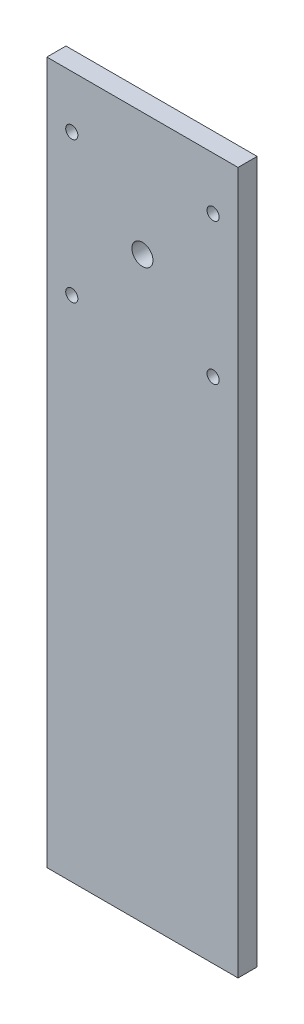
ISO-10303-21;
HEADER;
FILE_DESCRIPTION(('STEP AP214'),'2;1');
FILE_NAME('part.step','',(''),(''),'','','');
FILE_SCHEMA(('AUTOMOTIVE_DESIGN { 1 0 10303 214 1 1 1 1 }'));
ENDSEC;
DATA;
#1=APPLICATION_CONTEXT('core data for automotive mechanical design processes');
#2=APPLICATION_PROTOCOL_DEFINITION('international standard','automotive_design',2000,#1);
#3=PRODUCT_CONTEXT('',#1,'mechanical');
#4=PRODUCT('Part','Part','',(#3));
#5=PRODUCT_RELATED_PRODUCT_CATEGORY('part','',(#4));
#6=PRODUCT_DEFINITION_FORMATION('','',#4);
#7=PRODUCT_DEFINITION_CONTEXT('part definition',#1,'design');
#8=PRODUCT_DEFINITION('design','',#6,#7);
#9=PRODUCT_DEFINITION_SHAPE('','',#8);
#10=(LENGTH_UNIT() NAMED_UNIT(*) SI_UNIT(.MILLI.,.METRE.));
#11=(NAMED_UNIT(*) PLANE_ANGLE_UNIT() SI_UNIT($,.RADIAN.));
#12=(NAMED_UNIT(*) SI_UNIT($,.STERADIAN.) SOLID_ANGLE_UNIT());
#13=UNCERTAINTY_MEASURE_WITH_UNIT(LENGTH_MEASURE(1.E-05),#10,'distance_accuracy_value','');
#14=(GEOMETRIC_REPRESENTATION_CONTEXT(3) GLOBAL_UNCERTAINTY_ASSIGNED_CONTEXT((#13)) GLOBAL_UNIT_ASSIGNED_CONTEXT((#10,
#11,#12)) REPRESENTATION_CONTEXT('',''));
#15=CARTESIAN_POINT('',(0.,0.,0.));
#16=DIRECTION('',(0.,0.,1.));
#17=DIRECTION('',(1.,0.,0.));
#18=AXIS2_PLACEMENT_3D('',#15,#16,#17);
#19=CARTESIAN_POINT('',(0.,0.,6.35));
#20=DIRECTION('',(0.,0.,1.));
#21=DIRECTION('',(1.,0.,0.));
#22=AXIS2_PLACEMENT_3D('',#19,#20,#21);
#23=PLANE('',#22);
#24=CARTESIAN_POINT('',(8.2804,-17.4244,6.35));
#25=DIRECTION('',(0.,0.,1.));
#26=DIRECTION('',(1.,0.,0.));
#27=AXIS2_PLACEMENT_3D('',#24,#25,#26);
#28=CIRCLE('',#27,2.01929999999999);
#29=CARTESIAN_POINT('',(10.2997,-17.4244,6.35));
#30=VERTEX_POINT('',#29);
#31=EDGE_CURVE('E141',#30,#30,#28,.T.);
#32=ORIENTED_EDGE('',*,*,#31,.F.);
#33=EDGE_LOOP('',(#32));
#34=FACE_BOUND('',#33,.T.);
#35=CARTESIAN_POINT('',(55.2196,-17.4244,6.35));
#36=DIRECTION('',(0.,0.,1.));
#37=DIRECTION('',(1.,0.,0.));
#38=AXIS2_PLACEMENT_3D('',#35,#36,#37);
#39=CIRCLE('',#38,2.01929999999999);
#40=CARTESIAN_POINT('',(57.2389,-17.4244,6.35));
#41=VERTEX_POINT('',#40);
#42=EDGE_CURVE('E135',#41,#41,#39,.T.);
#43=ORIENTED_EDGE('',*,*,#42,.F.);
#44=EDGE_LOOP('',(#43));
#45=FACE_BOUND('',#44,.T.);
#46=CARTESIAN_POINT('',(55.2196,-64.3636,6.35));
#47=DIRECTION('',(0.,0.,1.));
#48=DIRECTION('',(1.,0.,0.));
#49=AXIS2_PLACEMENT_3D('',#46,#47,#48);
#50=CIRCLE('',#49,2.01929999999999);
#51=CARTESIAN_POINT('',(57.2389,-64.3636,6.35));
#52=VERTEX_POINT('',#51);
#53=EDGE_CURVE('E129',#52,#52,#50,.T.);
#54=ORIENTED_EDGE('',*,*,#53,.F.);
#55=EDGE_LOOP('',(#54));
#56=FACE_BOUND('',#55,.T.);
#57=CARTESIAN_POINT('',(8.2804,-64.3636,6.35));
#58=DIRECTION('',(0.,0.,1.));
#59=DIRECTION('',(1.,0.,0.));
#60=AXIS2_PLACEMENT_3D('',#57,#58,#59);
#61=CIRCLE('',#60,2.01929999999999);
#62=CARTESIAN_POINT('',(10.2997,-64.3636,6.35));
#63=VERTEX_POINT('',#62);
#64=EDGE_CURVE('E123',#63,#63,#61,.T.);
#65=ORIENTED_EDGE('',*,*,#64,.F.);
#66=EDGE_LOOP('',(#65));
#67=FACE_BOUND('',#66,.T.);
#68=DIRECTION('',(0.,-1.,0.));
#69=VECTOR('',#68,1.);
#70=CARTESIAN_POINT('',(0.,0.,6.35));
#71=LINE('',#70,#69);
#72=CARTESIAN_POINT('',(0.,0.,6.35));
#73=VERTEX_POINT('',#72);
#74=CARTESIAN_POINT('',(0.,-233.172,6.35));
#75=VERTEX_POINT('',#74);
#76=EDGE_CURVE('E88',#73,#75,#71,.T.);
#77=ORIENTED_EDGE('',*,*,#76,.T.);
#78=DIRECTION('',(1.,0.,0.));
#79=VECTOR('',#78,1.);
#80=CARTESIAN_POINT('',(0.,-233.172,6.35));
#81=LINE('',#80,#79);
#82=CARTESIAN_POINT('',(63.5000000000001,-233.172,6.35));
#83=VERTEX_POINT('',#82);
#84=EDGE_CURVE('E83',#75,#83,#81,.T.);
#85=ORIENTED_EDGE('',*,*,#84,.T.);
#86=DIRECTION('',(0.,1.,0.));
#87=VECTOR('',#86,1.);
#88=CARTESIAN_POINT('',(63.5,0.,6.35));
#89=LINE('',#88,#87);
#90=CARTESIAN_POINT('',(63.5,0.,6.35));
#91=VERTEX_POINT('',#90);
#92=EDGE_CURVE('E86',#83,#91,#89,.T.);
#93=ORIENTED_EDGE('',*,*,#92,.T.);
#94=DIRECTION('',(-1.,0.,0.));
#95=VECTOR('',#94,1.);
#96=CARTESIAN_POINT('',(0.,0.,6.35));
#97=LINE('',#96,#95);
#98=EDGE_CURVE('E53',#91,#73,#97,.T.);
#99=ORIENTED_EDGE('',*,*,#98,.T.);
#100=EDGE_LOOP('',(#77,#85,#93,#99));
#101=FACE_BOUND('',#100,.T.);
#102=CARTESIAN_POINT('',(31.75,-40.894,6.35));
#103=DIRECTION('',(0.,0.,1.));
#104=DIRECTION('',(1.,0.,0.));
#105=AXIS2_PLACEMENT_3D('',#102,#103,#104);
#106=CIRCLE('',#105,3.4925);
#107=CARTESIAN_POINT('',(35.2425,-40.894,6.35));
#108=VERTEX_POINT('',#107);
#109=EDGE_CURVE('E103',#108,#108,#106,.T.);
#110=ORIENTED_EDGE('',*,*,#109,.F.);
#111=EDGE_LOOP('',(#110));
#112=FACE_BOUND('',#111,.T.);
#113=ADVANCED_FACE('F36',(#34,#45,#56,#67,#101,#112),#23,.T.);
#114=CARTESIAN_POINT('',(0.,0.,0.));
#115=DIRECTION('',(0.,0.,1.));
#116=DIRECTION('',(1.,0.,0.));
#117=AXIS2_PLACEMENT_3D('',#114,#115,#116);
#118=PLANE('',#117);
#119=CARTESIAN_POINT('',(8.2804,-17.4244,0.));
#120=DIRECTION('',(0.,0.,1.));
#121=DIRECTION('',(1.,0.,0.));
#122=AXIS2_PLACEMENT_3D('',#119,#120,#121);
#123=CIRCLE('',#122,2.01929999999999);
#124=CARTESIAN_POINT('',(10.2997,-17.4244,0.));
#125=VERTEX_POINT('',#124);
#126=EDGE_CURVE('E138',#125,#125,#123,.T.);
#127=ORIENTED_EDGE('',*,*,#126,.T.);
#128=EDGE_LOOP('',(#127));
#129=FACE_BOUND('',#128,.T.);
#130=CARTESIAN_POINT('',(55.2196,-17.4244,0.));
#131=DIRECTION('',(0.,0.,1.));
#132=DIRECTION('',(1.,0.,0.));
#133=AXIS2_PLACEMENT_3D('',#130,#131,#132);
#134=CIRCLE('',#133,2.01929999999999);
#135=CARTESIAN_POINT('',(57.2389,-17.4244,0.));
#136=VERTEX_POINT('',#135);
#137=EDGE_CURVE('E132',#136,#136,#134,.T.);
#138=ORIENTED_EDGE('',*,*,#137,.T.);
#139=EDGE_LOOP('',(#138));
#140=FACE_BOUND('',#139,.T.);
#141=CARTESIAN_POINT('',(55.2196,-64.3636,0.));
#142=DIRECTION('',(0.,0.,1.));
#143=DIRECTION('',(1.,0.,0.));
#144=AXIS2_PLACEMENT_3D('',#141,#142,#143);
#145=CIRCLE('',#144,2.01929999999999);
#146=CARTESIAN_POINT('',(57.2389,-64.3636,0.));
#147=VERTEX_POINT('',#146);
#148=EDGE_CURVE('E126',#147,#147,#145,.T.);
#149=ORIENTED_EDGE('',*,*,#148,.T.);
#150=EDGE_LOOP('',(#149));
#151=FACE_BOUND('',#150,.T.);
#152=CARTESIAN_POINT('',(8.2804,-64.3636,0.));
#153=DIRECTION('',(0.,0.,1.));
#154=DIRECTION('',(1.,0.,0.));
#155=AXIS2_PLACEMENT_3D('',#152,#153,#154);
#156=CIRCLE('',#155,2.01929999999999);
#157=CARTESIAN_POINT('',(10.2997,-64.3636,0.));
#158=VERTEX_POINT('',#157);
#159=EDGE_CURVE('E118',#158,#158,#156,.T.);
#160=ORIENTED_EDGE('',*,*,#159,.T.);
#161=EDGE_LOOP('',(#160));
#162=FACE_BOUND('',#161,.T.);
#163=DIRECTION('',(0.,-1.,0.));
#164=VECTOR('',#163,1.);
#165=CARTESIAN_POINT('',(0.,0.,0.));
#166=LINE('',#165,#164);
#167=CARTESIAN_POINT('',(0.,0.,0.));
#168=VERTEX_POINT('',#167);
#169=CARTESIAN_POINT('',(0.,-233.172,0.));
#170=VERTEX_POINT('',#169);
#171=EDGE_CURVE('E100',#168,#170,#166,.T.);
#172=ORIENTED_EDGE('',*,*,#171,.F.);
#173=DIRECTION('',(-1.,0.,0.));
#174=VECTOR('',#173,1.);
#175=CARTESIAN_POINT('',(0.,0.,0.));
#176=LINE('',#175,#174);
#177=CARTESIAN_POINT('',(63.5,0.,0.));
#178=VERTEX_POINT('',#177);
#179=EDGE_CURVE('E76',#178,#168,#176,.T.);
#180=ORIENTED_EDGE('',*,*,#179,.F.);
#181=DIRECTION('',(0.,1.,0.));
#182=VECTOR('',#181,1.);
#183=CARTESIAN_POINT('',(63.5,0.,0.));
#184=LINE('',#183,#182);
#185=CARTESIAN_POINT('',(63.5000000000001,-233.172,0.));
#186=VERTEX_POINT('',#185);
#187=EDGE_CURVE('E70',#186,#178,#184,.T.);
#188=ORIENTED_EDGE('',*,*,#187,.F.);
#189=DIRECTION('',(1.,0.,0.));
#190=VECTOR('',#189,1.);
#191=CARTESIAN_POINT('',(0.,-233.172,0.));
#192=LINE('',#191,#190);
#193=EDGE_CURVE('E92',#170,#186,#192,.T.);
#194=ORIENTED_EDGE('',*,*,#193,.F.);
#195=EDGE_LOOP('',(#172,#180,#188,#194));
#196=FACE_BOUND('',#195,.T.);
#197=CARTESIAN_POINT('',(31.75,-40.894,0.));
#198=DIRECTION('',(0.,0.,1.));
#199=DIRECTION('',(1.,0.,0.));
#200=AXIS2_PLACEMENT_3D('',#197,#198,#199);
#201=CIRCLE('',#200,3.4925);
#202=CARTESIAN_POINT('',(35.2425,-40.894,0.));
#203=VERTEX_POINT('',#202);
#204=EDGE_CURVE('E115',#203,#203,#201,.T.);
#205=ORIENTED_EDGE('',*,*,#204,.T.);
#206=EDGE_LOOP('',(#205));
#207=FACE_BOUND('',#206,.T.);
#208=ADVANCED_FACE('F111',(#129,#140,#151,#162,#196,#207),#118,.F.);
#209=CARTESIAN_POINT('',(0.,0.,6.35));
#210=DIRECTION('',(1.,0.,0.));
#211=DIRECTION('',(0.,1.,0.));
#212=AXIS2_PLACEMENT_3D('',#209,#210,#211);
#213=PLANE('',#212);
#214=ORIENTED_EDGE('',*,*,#171,.T.);
#215=DIRECTION('',(0.,0.,-1.));
#216=VECTOR('',#215,1.);
#217=CARTESIAN_POINT('',(0.,-233.172,6.35));
#218=LINE('',#217,#216);
#219=EDGE_CURVE('E11',#75,#170,#218,.T.);
#220=ORIENTED_EDGE('',*,*,#219,.F.);
#221=ORIENTED_EDGE('',*,*,#76,.F.);
#222=DIRECTION('',(0.,0.,-1.));
#223=VECTOR('',#222,1.);
#224=CARTESIAN_POINT('',(0.,0.,6.35));
#225=LINE('',#224,#223);
#226=EDGE_CURVE('E96',#73,#168,#225,.T.);
#227=ORIENTED_EDGE('',*,*,#226,.T.);
#228=EDGE_LOOP('',(#214,#220,#221,#227));
#229=FACE_BOUND('',#228,.T.);
#230=ADVANCED_FACE('F38',(#229),#213,.F.);
#231=CARTESIAN_POINT('',(0.,-233.172,6.35));
#232=DIRECTION('',(0.,1.,0.));
#233=DIRECTION('',(0.,0.,1.));
#234=AXIS2_PLACEMENT_3D('',#231,#232,#233);
#235=PLANE('',#234);
#236=ORIENTED_EDGE('',*,*,#193,.T.);
#237=DIRECTION('',(0.,0.,-1.));
#238=VECTOR('',#237,1.);
#239=CARTESIAN_POINT('',(63.5000000000001,-233.172,6.35));
#240=LINE('',#239,#238);
#241=EDGE_CURVE('E45',#83,#186,#240,.T.);
#242=ORIENTED_EDGE('',*,*,#241,.F.);
#243=ORIENTED_EDGE('',*,*,#84,.F.);
#244=ORIENTED_EDGE('',*,*,#219,.T.);
#245=EDGE_LOOP('',(#236,#242,#243,#244));
#246=FACE_BOUND('',#245,.T.);
#247=ADVANCED_FACE('F91',(#246),#235,.F.);
#248=CARTESIAN_POINT('',(63.5,0.,6.35));
#249=DIRECTION('',(-1.,0.,0.));
#250=DIRECTION('',(0.,-1.,0.));
#251=AXIS2_PLACEMENT_3D('',#248,#249,#250);
#252=PLANE('',#251);
#253=ORIENTED_EDGE('',*,*,#187,.T.);
#254=DIRECTION('',(0.,0.,-1.));
#255=VECTOR('',#254,1.);
#256=CARTESIAN_POINT('',(63.5,0.,6.35));
#257=LINE('',#256,#255);
#258=EDGE_CURVE('E93',#91,#178,#257,.T.);
#259=ORIENTED_EDGE('',*,*,#258,.F.);
#260=ORIENTED_EDGE('',*,*,#92,.F.);
#261=ORIENTED_EDGE('',*,*,#241,.T.);
#262=EDGE_LOOP('',(#253,#259,#260,#261));
#263=FACE_BOUND('',#262,.T.);
#264=ADVANCED_FACE('F94',(#263),#252,.F.);
#265=CARTESIAN_POINT('',(0.,0.,6.35));
#266=DIRECTION('',(0.,-1.,0.));
#267=DIRECTION('',(0.,0.,-1.));
#268=AXIS2_PLACEMENT_3D('',#265,#266,#267);
#269=PLANE('',#268);
#270=ORIENTED_EDGE('',*,*,#179,.T.);
#271=ORIENTED_EDGE('',*,*,#226,.F.);
#272=ORIENTED_EDGE('',*,*,#98,.F.);
#273=ORIENTED_EDGE('',*,*,#258,.T.);
#274=EDGE_LOOP('',(#270,#271,#272,#273));
#275=FACE_BOUND('',#274,.T.);
#276=ADVANCED_FACE('F108',(#275),#269,.F.);
#277=CARTESIAN_POINT('',(31.75,-40.894,6.35));
#278=DIRECTION('',(0.,0.,-1.));
#279=DIRECTION('',(-1.,0.,0.));
#280=AXIS2_PLACEMENT_3D('',#277,#278,#279);
#281=CYLINDRICAL_SURFACE('',#280,3.4925);
#282=ORIENTED_EDGE('',*,*,#109,.T.);
#283=EDGE_LOOP('',(#282));
#284=FACE_BOUND('',#283,.T.);
#285=ORIENTED_EDGE('',*,*,#204,.F.);
#286=EDGE_LOOP('',(#285));
#287=FACE_BOUND('',#286,.T.);
#288=ADVANCED_FACE('F159',(#284,#287),#281,.F.);
#289=CARTESIAN_POINT('',(8.2804,-64.3636,6.35));
#290=DIRECTION('',(0.,0.,1.));
#291=DIRECTION('',(1.,0.,0.));
#292=AXIS2_PLACEMENT_3D('',#289,#290,#291);
#293=CYLINDRICAL_SURFACE('',#292,2.01929999999999);
#294=ORIENTED_EDGE('',*,*,#159,.F.);
#295=EDGE_LOOP('',(#294));
#296=FACE_BOUND('',#295,.T.);
#297=ORIENTED_EDGE('',*,*,#64,.T.);
#298=EDGE_LOOP('',(#297));
#299=FACE_BOUND('',#298,.T.);
#300=ADVANCED_FACE('F156',(#296,#299),#293,.F.);
#301=CARTESIAN_POINT('',(55.2196,-64.3636,6.35));
#302=DIRECTION('',(0.,0.,1.));
#303=DIRECTION('',(1.,0.,0.));
#304=AXIS2_PLACEMENT_3D('',#301,#302,#303);
#305=CYLINDRICAL_SURFACE('',#304,2.01929999999999);
#306=ORIENTED_EDGE('',*,*,#148,.F.);
#307=EDGE_LOOP('',(#306));
#308=FACE_BOUND('',#307,.T.);
#309=ORIENTED_EDGE('',*,*,#53,.T.);
#310=EDGE_LOOP('',(#309));
#311=FACE_BOUND('',#310,.T.);
#312=ADVANCED_FACE('F158',(#308,#311),#305,.F.);
#313=CARTESIAN_POINT('',(55.2196,-17.4244,6.35));
#314=DIRECTION('',(0.,0.,1.));
#315=DIRECTION('',(1.,0.,0.));
#316=AXIS2_PLACEMENT_3D('',#313,#314,#315);
#317=CYLINDRICAL_SURFACE('',#316,2.01929999999999);
#318=ORIENTED_EDGE('',*,*,#137,.F.);
#319=EDGE_LOOP('',(#318));
#320=FACE_BOUND('',#319,.T.);
#321=ORIENTED_EDGE('',*,*,#42,.T.);
#322=EDGE_LOOP('',(#321));
#323=FACE_BOUND('',#322,.T.);
#324=ADVANCED_FACE('F166',(#320,#323),#317,.F.);
#325=CARTESIAN_POINT('',(8.2804,-17.4244,6.35));
#326=DIRECTION('',(0.,0.,1.));
#327=DIRECTION('',(1.,0.,0.));
#328=AXIS2_PLACEMENT_3D('',#325,#326,#327);
#329=CYLINDRICAL_SURFACE('',#328,2.01929999999999);
#330=ORIENTED_EDGE('',*,*,#126,.F.);
#331=EDGE_LOOP('',(#330));
#332=FACE_BOUND('',#331,.T.);
#333=ORIENTED_EDGE('',*,*,#31,.T.);
#334=EDGE_LOOP('',(#333));
#335=FACE_BOUND('',#334,.T.);
#336=ADVANCED_FACE('F145',(#332,#335),#329,.F.);
#337=CLOSED_SHELL('',(#113,#208,#230,#247,#264,#276,#288,#300,#312,#324,#336));
#338=MANIFOLD_SOLID_BREP('B2',#337);
#339=ADVANCED_BREP_SHAPE_REPRESENTATION('',(#18,#338),#14);
#340=SHAPE_DEFINITION_REPRESENTATION(#9,#339);
ENDSEC;
END-ISO-10303-21;
